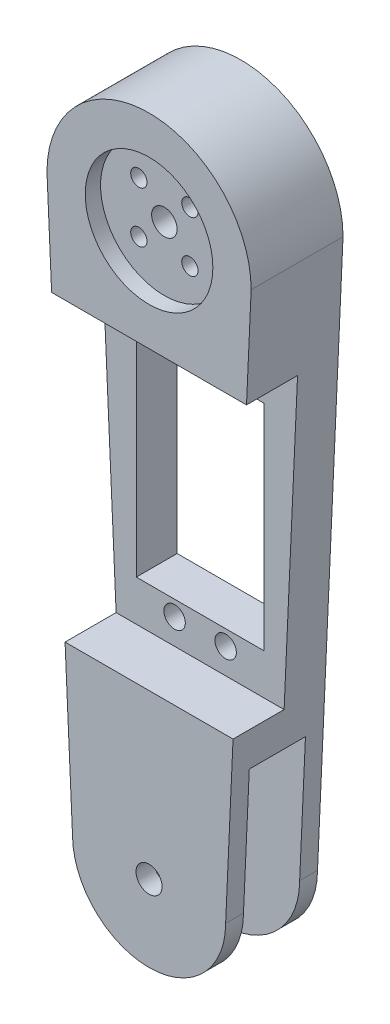
ISO-10303-21;
HEADER;
FILE_DESCRIPTION(('STEP AP214'),'2;1');
FILE_NAME('part.step','',(''),(''),'','','');
FILE_SCHEMA(('AUTOMOTIVE_DESIGN { 1 0 10303 214 1 1 1 1 }'));
ENDSEC;
DATA;
#1=APPLICATION_CONTEXT('core data for automotive mechanical design processes');
#2=APPLICATION_PROTOCOL_DEFINITION('international standard','automotive_design',2000,#1);
#3=PRODUCT_CONTEXT('',#1,'mechanical');
#4=PRODUCT('Part','Part','',(#3));
#5=PRODUCT_RELATED_PRODUCT_CATEGORY('part','',(#4));
#6=PRODUCT_DEFINITION_FORMATION('','',#4);
#7=PRODUCT_DEFINITION_CONTEXT('part definition',#1,'design');
#8=PRODUCT_DEFINITION('design','',#6,#7);
#9=PRODUCT_DEFINITION_SHAPE('','',#8);
#10=(LENGTH_UNIT() NAMED_UNIT(*) SI_UNIT(.MILLI.,.METRE.));
#11=(NAMED_UNIT(*) PLANE_ANGLE_UNIT() SI_UNIT($,.RADIAN.));
#12=(NAMED_UNIT(*) SI_UNIT($,.STERADIAN.) SOLID_ANGLE_UNIT());
#13=UNCERTAINTY_MEASURE_WITH_UNIT(LENGTH_MEASURE(1.E-05),#10,'distance_accuracy_value','');
#14=(GEOMETRIC_REPRESENTATION_CONTEXT(3) GLOBAL_UNCERTAINTY_ASSIGNED_CONTEXT((#13)) GLOBAL_UNIT_ASSIGNED_CONTEXT((#10,
#11,#12)) REPRESENTATION_CONTEXT('',''));
#15=CARTESIAN_POINT('',(0.,0.,0.));
#16=DIRECTION('',(0.,0.,1.));
#17=DIRECTION('',(1.,0.,0.));
#18=AXIS2_PLACEMENT_3D('',#15,#16,#17);
#19=CARTESIAN_POINT('',(0.,0.,18.));
#20=DIRECTION('',(0.,0.,1.));
#21=DIRECTION('',(1.,0.,0.));
#22=AXIS2_PLACEMENT_3D('',#19,#20,#21);
#23=PLANE('',#22);
#24=DIRECTION('',(-1.,0.,0.));
#25=VECTOR('',#24,1.);
#26=CARTESIAN_POINT('',(0.,90.,18.));
#27=LINE('',#26,#25);
#28=CARTESIAN_POINT('',(19.0909090909091,90.,18.));
#29=VERTEX_POINT('',#28);
#30=CARTESIAN_POINT('',(-19.0909090909091,90.,18.));
#31=VERTEX_POINT('',#30);
#32=EDGE_CURVE('E56',#29,#31,#27,.T.);
#33=ORIENTED_EDGE('',*,*,#32,.F.);
#34=DIRECTION('',(-0.0454076609186499,-0.9989685402103,0.));
#35=VECTOR('',#34,1.);
#36=CARTESIAN_POINT('',(14.9690721649485,-0.680412371134019,18.));
#37=LINE('',#36,#35);
#38=CARTESIAN_POINT('',(20.,110.,18.));
#39=VERTEX_POINT('',#38);
#40=EDGE_CURVE('E340',#39,#29,#37,.T.);
#41=ORIENTED_EDGE('',*,*,#40,.F.);
#42=CARTESIAN_POINT('',(0.,110.,18.));
#43=DIRECTION('',(0.,0.,1.));
#44=DIRECTION('',(1.,0.,0.));
#45=AXIS2_PLACEMENT_3D('',#42,#43,#44);
#46=CIRCLE('',#45,20.);
#47=CARTESIAN_POINT('',(-20.,110.,18.));
#48=VERTEX_POINT('',#47);
#49=EDGE_CURVE('E344',#39,#48,#46,.T.);
#50=ORIENTED_EDGE('',*,*,#49,.T.);
#51=DIRECTION('',(0.0454076609186501,-0.9989685402103,0.));
#52=VECTOR('',#51,1.);
#53=CARTESIAN_POINT('',(-14.9690721649485,-0.680412371134023,18.));
#54=LINE('',#53,#52);
#55=EDGE_CURVE('E348',#48,#31,#54,.T.);
#56=ORIENTED_EDGE('',*,*,#55,.T.);
#57=EDGE_LOOP('',(#33,#41,#50,#56));
#58=FACE_BOUND('',#57,.T.);
#59=CARTESIAN_POINT('',(0.,110.,18.));
#60=DIRECTION('',(0.,0.,1.));
#61=DIRECTION('',(1.,0.,0.));
#62=AXIS2_PLACEMENT_3D('',#59,#60,#61);
#63=CIRCLE('',#62,12.5);
#64=CARTESIAN_POINT('',(12.5,110.,18.));
#65=VERTEX_POINT('',#64);
#66=EDGE_CURVE('E316',#65,#65,#63,.T.);
#67=ORIENTED_EDGE('',*,*,#66,.F.);
#68=EDGE_LOOP('',(#67));
#69=FACE_BOUND('',#68,.T.);
#70=ADVANCED_FACE('F47',(#58,#69),#23,.T.);
#71=CARTESIAN_POINT('',(0.,0.,18.));
#72=DIRECTION('',(0.,0.,-1.));
#73=DIRECTION('',(-1.,0.,0.));
#74=AXIS2_PLACEMENT_3D('',#71,#72,#73);
#75=CYLINDRICAL_SURFACE('',#74,15.);
#76=CARTESIAN_POINT('',(0.,0.,3.5));
#77=DIRECTION('',(0.,0.,-1.));
#78=DIRECTION('',(-1.,0.,0.));
#79=AXIS2_PLACEMENT_3D('',#76,#77,#78);
#80=CIRCLE('',#79,15.);
#81=CARTESIAN_POINT('',(15.,0.,3.5));
#82=VERTEX_POINT('',#81);
#83=CARTESIAN_POINT('',(-15.,0.,3.5));
#84=VERTEX_POINT('',#83);
#85=EDGE_CURVE('E264',#82,#84,#80,.T.);
#86=ORIENTED_EDGE('',*,*,#85,.T.);
#87=DIRECTION('',(0.,0.,-1.));
#88=VECTOR('',#87,1.);
#89=CARTESIAN_POINT('',(-15.,0.,18.));
#90=LINE('',#89,#88);
#91=CARTESIAN_POINT('',(-15.,0.,0.));
#92=VERTEX_POINT('',#91);
#93=EDGE_CURVE('E352',#84,#92,#90,.T.);
#94=ORIENTED_EDGE('',*,*,#93,.T.);
#95=CARTESIAN_POINT('',(0.,0.,0.));
#96=DIRECTION('',(0.,0.,1.));
#97=DIRECTION('',(1.,0.,0.));
#98=AXIS2_PLACEMENT_3D('',#95,#96,#97);
#99=CIRCLE('',#98,15.);
#100=CARTESIAN_POINT('',(15.,0.,0.));
#101=VERTEX_POINT('',#100);
#102=EDGE_CURVE('E356',#92,#101,#99,.T.);
#103=ORIENTED_EDGE('',*,*,#102,.T.);
#104=DIRECTION('',(0.,0.,-1.));
#105=VECTOR('',#104,1.);
#106=CARTESIAN_POINT('',(15.,0.,18.));
#107=LINE('',#106,#105);
#108=EDGE_CURVE('E381',#82,#101,#107,.T.);
#109=ORIENTED_EDGE('',*,*,#108,.F.);
#110=EDGE_LOOP('',(#86,#94,#103,#109));
#111=FACE_BOUND('',#110,.T.);
#112=ADVANCED_FACE('F444',(#111),#75,.T.);
#113=CARTESIAN_POINT('',(0.,0.,18.));
#114=DIRECTION('',(0.,0.,-1.));
#115=DIRECTION('',(-1.,0.,0.));
#116=AXIS2_PLACEMENT_3D('',#113,#114,#115);
#117=CYLINDRICAL_SURFACE('',#116,2.55);
#118=CARTESIAN_POINT('',(0.,0.,14.5));
#119=DIRECTION('',(0.,0.,1.));
#120=DIRECTION('',(1.,0.,0.));
#121=AXIS2_PLACEMENT_3D('',#118,#119,#120);
#122=CIRCLE('',#121,2.55);
#123=CARTESIAN_POINT('',(2.55,0.,14.5));
#124=VERTEX_POINT('',#123);
#125=EDGE_CURVE('E287',#124,#124,#122,.T.);
#126=ORIENTED_EDGE('',*,*,#125,.F.);
#127=EDGE_LOOP('',(#126));
#128=FACE_BOUND('',#127,.T.);
#129=CARTESIAN_POINT('',(0.,0.,18.));
#130=DIRECTION('',(0.,0.,1.));
#131=DIRECTION('',(1.,0.,0.));
#132=AXIS2_PLACEMENT_3D('',#129,#130,#131);
#133=CIRCLE('',#132,2.55);
#134=CARTESIAN_POINT('',(2.55,0.,18.));
#135=VERTEX_POINT('',#134);
#136=EDGE_CURVE('E330',#135,#135,#133,.T.);
#137=ORIENTED_EDGE('',*,*,#136,.T.);
#138=EDGE_LOOP('',(#137));
#139=FACE_BOUND('',#138,.T.);
#140=ADVANCED_FACE('F500',(#128,#139),#117,.F.);
#141=CARTESIAN_POINT('',(0.,0.,14.5));
#142=DIRECTION('',(0.,0.,1.));
#143=DIRECTION('',(1.,0.,0.));
#144=AXIS2_PLACEMENT_3D('',#141,#142,#143);
#145=CIRCLE('',#144,15.);
#146=CARTESIAN_POINT('',(-15.,0.,14.5));
#147=VERTEX_POINT('',#146);
#148=CARTESIAN_POINT('',(15.,0.,14.5));
#149=VERTEX_POINT('',#148);
#150=EDGE_CURVE('E280',#147,#149,#145,.T.);
#151=ORIENTED_EDGE('',*,*,#150,.T.);
#152=CARTESIAN_POINT('',(15.,0.,18.));
#153=VERTEX_POINT('',#152);
#154=EDGE_CURVE('E382',#153,#149,#107,.T.);
#155=ORIENTED_EDGE('',*,*,#154,.F.);
#156=CARTESIAN_POINT('',(0.,0.,18.));
#157=DIRECTION('',(0.,0.,1.));
#158=DIRECTION('',(1.,0.,0.));
#159=AXIS2_PLACEMENT_3D('',#156,#157,#158);
#160=CIRCLE('',#159,15.);
#161=CARTESIAN_POINT('',(-15.,0.,18.));
#162=VERTEX_POINT('',#161);
#163=EDGE_CURVE('E334',#162,#153,#160,.T.);
#164=ORIENTED_EDGE('',*,*,#163,.F.);
#165=EDGE_CURVE('E370',#162,#147,#90,.T.);
#166=ORIENTED_EDGE('',*,*,#165,.T.);
#167=EDGE_LOOP('',(#151,#155,#164,#166));
#168=FACE_BOUND('',#167,.T.);
#169=ADVANCED_FACE('F463',(#168),#75,.T.);
#170=CARTESIAN_POINT('',(14.9690721649485,-0.680412371134019,18.));
#171=DIRECTION('',(0.9989685402103,-0.0454076609186499,0.));
#172=DIRECTION('',(0.0454076609186499,0.9989685402103,0.));
#173=AXIS2_PLACEMENT_3D('',#170,#171,#172);
#174=PLANE('',#173);
#175=DIRECTION('',(0.,0.,1.));
#176=VECTOR('',#175,1.);
#177=CARTESIAN_POINT('',(19.0909090909091,90.,18.));
#178=LINE('',#177,#176);
#179=CARTESIAN_POINT('',(19.0909090909091,90.,8.));
#180=VERTEX_POINT('',#179);
#181=EDGE_CURVE('E252',#180,#29,#178,.T.);
#182=ORIENTED_EDGE('',*,*,#181,.F.);
#183=DIRECTION('',(-0.0454076609186499,-0.9989685402103,0.));
#184=VECTOR('',#183,1.);
#185=CARTESIAN_POINT('',(14.9690721649485,-0.680412371134019,8.));
#186=LINE('',#185,#184);
#187=CARTESIAN_POINT('',(16.4545454545455,32.,8.));
#188=VERTEX_POINT('',#187);
#189=EDGE_CURVE('E255',#180,#188,#186,.T.);
#190=ORIENTED_EDGE('',*,*,#189,.T.);
#191=DIRECTION('',(0.,0.,-1.));
#192=VECTOR('',#191,1.);
#193=CARTESIAN_POINT('',(16.4545454545454,32.,18.));
#194=LINE('',#193,#192);
#195=CARTESIAN_POINT('',(16.4545454545454,32.,18.));
#196=VERTEX_POINT('',#195);
#197=EDGE_CURVE('E245',#196,#188,#194,.T.);
#198=ORIENTED_EDGE('',*,*,#197,.F.);
#199=EDGE_CURVE('E339',#196,#153,#37,.T.);
#200=ORIENTED_EDGE('',*,*,#199,.T.);
#201=ORIENTED_EDGE('',*,*,#154,.T.);
#202=DIRECTION('',(-0.0454076609186499,-0.9989685402103,0.));
#203=VECTOR('',#202,1.);
#204=CARTESIAN_POINT('',(14.9690721649485,-0.680412371134019,14.5));
#205=LINE('',#204,#203);
#206=CARTESIAN_POINT('',(16.1363636363636,25.,14.5));
#207=VERTEX_POINT('',#206);
#208=EDGE_CURVE('E283',#207,#149,#205,.T.);
#209=ORIENTED_EDGE('',*,*,#208,.F.);
#210=DIRECTION('',(0.,0.,1.));
#211=VECTOR('',#210,1.);
#212=CARTESIAN_POINT('',(16.1363636363636,25.,18.));
#213=LINE('',#212,#211);
#214=CARTESIAN_POINT('',(16.1363636363636,25.,3.5));
#215=VERTEX_POINT('',#214);
#216=EDGE_CURVE('E277',#215,#207,#213,.T.);
#217=ORIENTED_EDGE('',*,*,#216,.F.);
#218=DIRECTION('',(0.0454076609186499,0.9989685402103,0.));
#219=VECTOR('',#218,1.);
#220=CARTESIAN_POINT('',(14.9690721649485,-0.680412371134019,3.5));
#221=LINE('',#220,#219);
#222=EDGE_CURVE('E270',#82,#215,#221,.T.);
#223=ORIENTED_EDGE('',*,*,#222,.F.);
#224=ORIENTED_EDGE('',*,*,#108,.T.);
#225=DIRECTION('',(-0.0454076609186499,-0.9989685402103,0.));
#226=VECTOR('',#225,1.);
#227=CARTESIAN_POINT('',(14.9690721649485,-0.680412371134019,0.));
#228=LINE('',#227,#226);
#229=CARTESIAN_POINT('',(20.,110.,0.));
#230=VERTEX_POINT('',#229);
#231=EDGE_CURVE('E360',#230,#101,#228,.T.);
#232=ORIENTED_EDGE('',*,*,#231,.F.);
#233=DIRECTION('',(0.,0.,-1.));
#234=VECTOR('',#233,1.);
#235=CARTESIAN_POINT('',(20.,110.,18.));
#236=LINE('',#235,#234);
#237=EDGE_CURVE('E378',#39,#230,#236,.T.);
#238=ORIENTED_EDGE('',*,*,#237,.F.);
#239=ORIENTED_EDGE('',*,*,#40,.T.);
#240=EDGE_LOOP('',(#182,#190,#198,#200,#201,#209,#217,#223,#224,#232,#238,#239));
#241=FACE_BOUND('',#240,.T.);
#242=ADVANCED_FACE('F452',(#241),#174,.T.);
#243=CARTESIAN_POINT('',(0.,110.,18.));
#244=DIRECTION('',(0.,0.,-1.));
#245=DIRECTION('',(-1.,0.,0.));
#246=AXIS2_PLACEMENT_3D('',#243,#244,#245);
#247=CYLINDRICAL_SURFACE('',#246,20.);
#248=CARTESIAN_POINT('',(0.,110.,0.));
#249=DIRECTION('',(0.,0.,1.));
#250=DIRECTION('',(1.,0.,0.));
#251=AXIS2_PLACEMENT_3D('',#248,#249,#250);
#252=CIRCLE('',#251,20.);
#253=CARTESIAN_POINT('',(-20.,110.,0.));
#254=VERTEX_POINT('',#253);
#255=EDGE_CURVE('E364',#230,#254,#252,.T.);
#256=ORIENTED_EDGE('',*,*,#255,.T.);
#257=DIRECTION('',(0.,0.,-1.));
#258=VECTOR('',#257,1.);
#259=CARTESIAN_POINT('',(-20.,110.,18.));
#260=LINE('',#259,#258);
#261=EDGE_CURVE('E374',#48,#254,#260,.T.);
#262=ORIENTED_EDGE('',*,*,#261,.F.);
#263=ORIENTED_EDGE('',*,*,#49,.F.);
#264=ORIENTED_EDGE('',*,*,#237,.T.);
#265=EDGE_LOOP('',(#256,#262,#263,#264));
#266=FACE_BOUND('',#265,.T.);
#267=ADVANCED_FACE('F434',(#266),#247,.T.);
#268=CARTESIAN_POINT('',(0.,0.,3.5));
#269=DIRECTION('',(0.,0.,-1.));
#270=DIRECTION('',(-1.,0.,0.));
#271=AXIS2_PLACEMENT_3D('',#268,#269,#270);
#272=CIRCLE('',#271,2.55);
#273=CARTESIAN_POINT('',(-2.55,0.,3.5));
#274=VERTEX_POINT('',#273);
#275=EDGE_CURVE('E273',#274,#274,#272,.T.);
#276=ORIENTED_EDGE('',*,*,#275,.F.);
#277=EDGE_LOOP('',(#276));
#278=FACE_BOUND('',#277,.T.);
#279=CARTESIAN_POINT('',(0.,0.,0.));
#280=DIRECTION('',(0.,0.,1.));
#281=DIRECTION('',(1.,0.,0.));
#282=AXIS2_PLACEMENT_3D('',#279,#280,#281);
#283=CIRCLE('',#282,2.55);
#284=CARTESIAN_POINT('',(2.55,0.,0.));
#285=VERTEX_POINT('',#284);
#286=EDGE_CURVE('E326',#285,#285,#283,.T.);
#287=ORIENTED_EDGE('',*,*,#286,.F.);
#288=EDGE_LOOP('',(#287));
#289=FACE_BOUND('',#288,.T.);
#290=ADVANCED_FACE('F49',(#278,#289),#117,.F.);
#291=CARTESIAN_POINT('',(-14.9690721649485,-0.680412371134023,18.));
#292=DIRECTION('',(0.9989685402103,0.0454076609186501,0.));
#293=DIRECTION('',(-0.0454076609186501,0.9989685402103,0.));
#294=AXIS2_PLACEMENT_3D('',#291,#292,#293);
#295=PLANE('',#294);
#296=DIRECTION('',(0.0454076609186501,-0.9989685402103,0.));
#297=VECTOR('',#296,1.);
#298=CARTESIAN_POINT('',(-14.9690721649485,-0.680412371134023,8.));
#299=LINE('',#298,#297);
#300=CARTESIAN_POINT('',(-19.0909090909091,90.,8.));
#301=VERTEX_POINT('',#300);
#302=CARTESIAN_POINT('',(-16.4545454545455,32.,8.));
#303=VERTEX_POINT('',#302);
#304=EDGE_CURVE('E11',#301,#303,#299,.T.);
#305=ORIENTED_EDGE('',*,*,#304,.F.);
#306=DIRECTION('',(0.,0.,1.));
#307=VECTOR('',#306,1.);
#308=CARTESIAN_POINT('',(-19.0909090909091,90.,18.));
#309=LINE('',#308,#307);
#310=EDGE_CURVE('E248',#301,#31,#309,.T.);
#311=ORIENTED_EDGE('',*,*,#310,.T.);
#312=ORIENTED_EDGE('',*,*,#55,.F.);
#313=ORIENTED_EDGE('',*,*,#261,.T.);
#314=DIRECTION('',(0.0454076609186501,-0.9989685402103,0.));
#315=VECTOR('',#314,1.);
#316=CARTESIAN_POINT('',(-14.9690721649485,-0.680412371134023,0.));
#317=LINE('',#316,#315);
#318=EDGE_CURVE('E335',#254,#92,#317,.T.);
#319=ORIENTED_EDGE('',*,*,#318,.T.);
#320=ORIENTED_EDGE('',*,*,#93,.F.);
#321=DIRECTION('',(-0.0454076609186501,0.9989685402103,0.));
#322=VECTOR('',#321,1.);
#323=CARTESIAN_POINT('',(-14.9690721649485,-0.680412371134023,3.5));
#324=LINE('',#323,#322);
#325=CARTESIAN_POINT('',(-16.1363636363636,25.,3.5));
#326=VERTEX_POINT('',#325);
#327=EDGE_CURVE('E386',#84,#326,#324,.T.);
#328=ORIENTED_EDGE('',*,*,#327,.T.);
#329=DIRECTION('',(0.,0.,1.));
#330=VECTOR('',#329,1.);
#331=CARTESIAN_POINT('',(-16.1363636363636,25.,18.));
#332=LINE('',#331,#330);
#333=CARTESIAN_POINT('',(-16.1363636363636,25.,14.5));
#334=VERTEX_POINT('',#333);
#335=EDGE_CURVE('E408',#326,#334,#332,.T.);
#336=ORIENTED_EDGE('',*,*,#335,.T.);
#337=DIRECTION('',(0.0454076609186501,-0.9989685402103,0.));
#338=VECTOR('',#337,1.);
#339=CARTESIAN_POINT('',(-14.9690721649485,-0.680412371134023,14.5));
#340=LINE('',#339,#338);
#341=EDGE_CURVE('E412',#334,#147,#340,.T.);
#342=ORIENTED_EDGE('',*,*,#341,.T.);
#343=ORIENTED_EDGE('',*,*,#165,.F.);
#344=CARTESIAN_POINT('',(-16.4545454545455,32.,18.));
#345=VERTEX_POINT('',#344);
#346=EDGE_CURVE('E347',#345,#162,#54,.T.);
#347=ORIENTED_EDGE('',*,*,#346,.F.);
#348=DIRECTION('',(0.,0.,-1.));
#349=VECTOR('',#348,1.);
#350=CARTESIAN_POINT('',(-16.4545454545455,32.,18.));
#351=LINE('',#350,#349);
#352=EDGE_CURVE('E241',#345,#303,#351,.T.);
#353=ORIENTED_EDGE('',*,*,#352,.T.);
#354=EDGE_LOOP('',(#305,#311,#312,#313,#319,#320,#328,#336,#342,#343,#347,#353));
#355=FACE_BOUND('',#354,.T.);
#356=ADVANCED_FACE('F429',(#355),#295,.F.);
#357=DIRECTION('',(1.,0.,0.));
#358=VECTOR('',#357,1.);
#359=CARTESIAN_POINT('',(0.,32.,18.));
#360=LINE('',#359,#358);
#361=EDGE_CURVE('E416',#345,#196,#360,.T.);
#362=ORIENTED_EDGE('',*,*,#361,.F.);
#363=ORIENTED_EDGE('',*,*,#346,.T.);
#364=ORIENTED_EDGE('',*,*,#163,.T.);
#365=ORIENTED_EDGE('',*,*,#199,.F.);
#366=EDGE_LOOP('',(#362,#363,#364,#365));
#367=FACE_BOUND('',#366,.T.);
#368=ORIENTED_EDGE('',*,*,#136,.F.);
#369=EDGE_LOOP('',(#368));
#370=FACE_BOUND('',#369,.T.);
#371=ADVANCED_FACE('F458',(#367,#370),#23,.T.);
#372=CARTESIAN_POINT('',(0.,0.,0.));
#373=DIRECTION('',(0.,0.,1.));
#374=DIRECTION('',(1.,0.,0.));
#375=AXIS2_PLACEMENT_3D('',#372,#373,#374);
#376=PLANE('',#375);
#377=CARTESIAN_POINT('',(-5.00000000000001,37.,0.));
#378=DIRECTION('',(0.,0.,1.));
#379=DIRECTION('',(-1.,0.,0.));
#380=AXIS2_PLACEMENT_3D('',#377,#378,#379);
#381=CIRCLE('',#380,2.1);
#382=CARTESIAN_POINT('',(-7.10000000000001,37.,0.));
#383=VERTEX_POINT('',#382);
#384=EDGE_CURVE('E226',#383,#383,#381,.T.);
#385=ORIENTED_EDGE('',*,*,#384,.T.);
#386=EDGE_LOOP('',(#385));
#387=FACE_BOUND('',#386,.T.);
#388=CARTESIAN_POINT('',(5.00000000000017,37.0000000000002,0.));
#389=DIRECTION('',(0.,0.,1.));
#390=DIRECTION('',(1.,0.,0.));
#391=AXIS2_PLACEMENT_3D('',#388,#389,#390);
#392=CIRCLE('',#391,2.10000000000001);
#393=CARTESIAN_POINT('',(7.10000000000018,37.0000000000002,0.));
#394=VERTEX_POINT('',#393);
#395=EDGE_CURVE('E218',#394,#394,#392,.T.);
#396=ORIENTED_EDGE('',*,*,#395,.T.);
#397=EDGE_LOOP('',(#396));
#398=FACE_BOUND('',#397,.T.);
#399=CARTESIAN_POINT('',(5.00000000000017,84.9999999999998,0.));
#400=DIRECTION('',(0.,0.,1.));
#401=DIRECTION('',(-1.,0.,0.));
#402=AXIS2_PLACEMENT_3D('',#399,#400,#401);
#403=CIRCLE('',#402,2.10000000000001);
#404=CARTESIAN_POINT('',(2.90000000000016,84.9999999999998,0.));
#405=VERTEX_POINT('',#404);
#406=EDGE_CURVE('E210',#405,#405,#403,.T.);
#407=ORIENTED_EDGE('',*,*,#406,.T.);
#408=EDGE_LOOP('',(#407));
#409=FACE_BOUND('',#408,.T.);
#410=DIRECTION('',(-1.,0.,0.));
#411=VECTOR('',#410,1.);
#412=CARTESIAN_POINT('',(-12.5,82.,0.));
#413=LINE('',#412,#411);
#414=CARTESIAN_POINT('',(12.5,82.,0.));
#415=VERTEX_POINT('',#414);
#416=CARTESIAN_POINT('',(-12.5,82.,0.));
#417=VERTEX_POINT('',#416);
#418=EDGE_CURVE('E195',#415,#417,#413,.T.);
#419=ORIENTED_EDGE('',*,*,#418,.T.);
#420=DIRECTION('',(0.,-1.,0.));
#421=VECTOR('',#420,1.);
#422=CARTESIAN_POINT('',(-12.5,82.,0.));
#423=LINE('',#422,#421);
#424=CARTESIAN_POINT('',(-12.5,40.,0.));
#425=VERTEX_POINT('',#424);
#426=EDGE_CURVE('E162',#417,#425,#423,.T.);
#427=ORIENTED_EDGE('',*,*,#426,.T.);
#428=DIRECTION('',(1.,0.,0.));
#429=VECTOR('',#428,1.);
#430=CARTESIAN_POINT('',(-12.5,40.,0.));
#431=LINE('',#430,#429);
#432=CARTESIAN_POINT('',(12.5,40.,0.));
#433=VERTEX_POINT('',#432);
#434=EDGE_CURVE('E201',#425,#433,#431,.T.);
#435=ORIENTED_EDGE('',*,*,#434,.T.);
#436=DIRECTION('',(0.,1.,0.));
#437=VECTOR('',#436,1.);
#438=CARTESIAN_POINT('',(12.5,82.,0.));
#439=LINE('',#438,#437);
#440=EDGE_CURVE('E63',#433,#415,#439,.T.);
#441=ORIENTED_EDGE('',*,*,#440,.T.);
#442=EDGE_LOOP('',(#419,#427,#435,#441));
#443=FACE_BOUND('',#442,.T.);
#444=CARTESIAN_POINT('',(-5.00000000000001,85.,0.));
#445=DIRECTION('',(0.,0.,1.));
#446=DIRECTION('',(1.,0.,0.));
#447=AXIS2_PLACEMENT_3D('',#444,#445,#446);
#448=CIRCLE('',#447,2.10000000000001);
#449=CARTESIAN_POINT('',(-2.9,85.,0.));
#450=VERTEX_POINT('',#449);
#451=EDGE_CURVE('E190',#450,#450,#448,.T.);
#452=ORIENTED_EDGE('',*,*,#451,.T.);
#453=EDGE_LOOP('',(#452));
#454=FACE_BOUND('',#453,.T.);
#455=CARTESIAN_POINT('',(0.,110.,0.));
#456=DIRECTION('',(0.,0.,-1.));
#457=DIRECTION('',(-1.,0.,0.));
#458=AXIS2_PLACEMENT_3D('',#455,#456,#457);
#459=CIRCLE('',#458,12.5);
#460=CARTESIAN_POINT('',(-12.5,110.,0.));
#461=VERTEX_POINT('',#460);
#462=EDGE_CURVE('E317',#461,#461,#459,.T.);
#463=ORIENTED_EDGE('',*,*,#462,.F.);
#464=EDGE_LOOP('',(#463));
#465=FACE_BOUND('',#464,.T.);
#466=ORIENTED_EDGE('',*,*,#286,.T.);
#467=EDGE_LOOP('',(#466));
#468=FACE_BOUND('',#467,.T.);
#469=ORIENTED_EDGE('',*,*,#102,.F.);
#470=ORIENTED_EDGE('',*,*,#318,.F.);
#471=ORIENTED_EDGE('',*,*,#255,.F.);
#472=ORIENTED_EDGE('',*,*,#231,.T.);
#473=EDGE_LOOP('',(#469,#470,#471,#472));
#474=FACE_BOUND('',#473,.T.);
#475=ADVANCED_FACE('F440',(#387,#398,#409,#443,#454,#465,#468,#474),#376,.F.);
#476=CARTESIAN_POINT('',(0.,110.,15.));
#477=DIRECTION('',(0.,0.,1.));
#478=DIRECTION('',(1.,0.,0.));
#479=AXIS2_PLACEMENT_3D('',#476,#477,#478);
#480=CYLINDRICAL_SURFACE('',#479,12.5);
#481=CARTESIAN_POINT('',(0.,110.,15.));
#482=DIRECTION('',(0.,0.,1.));
#483=DIRECTION('',(1.,0.,0.));
#484=AXIS2_PLACEMENT_3D('',#481,#482,#483);
#485=CIRCLE('',#484,12.5);
#486=CARTESIAN_POINT('',(12.5,110.,15.));
#487=VERTEX_POINT('',#486);
#488=EDGE_CURVE('E322',#487,#487,#485,.T.);
#489=ORIENTED_EDGE('',*,*,#488,.F.);
#490=EDGE_LOOP('',(#489));
#491=FACE_BOUND('',#490,.T.);
#492=ORIENTED_EDGE('',*,*,#66,.T.);
#493=EDGE_LOOP('',(#492));
#494=FACE_BOUND('',#493,.T.);
#495=ADVANCED_FACE('F507',(#491,#494),#480,.F.);
#496=CARTESIAN_POINT('',(0.,110.,15.));
#497=DIRECTION('',(0.,0.,1.));
#498=DIRECTION('',(1.,0.,0.));
#499=AXIS2_PLACEMENT_3D('',#496,#497,#498);
#500=PLANE('',#499);
#501=CARTESIAN_POINT('',(0.,110.,15.));
#502=DIRECTION('',(0.,0.,1.));
#503=DIRECTION('',(1.,0.,0.));
#504=AXIS2_PLACEMENT_3D('',#501,#502,#503);
#505=CIRCLE('',#504,2.5);
#506=CARTESIAN_POINT('',(2.49999999999999,110.,15.));
#507=VERTEX_POINT('',#506);
#508=EDGE_CURVE('E296',#507,#507,#505,.T.);
#509=ORIENTED_EDGE('',*,*,#508,.F.);
#510=EDGE_LOOP('',(#509));
#511=FACE_BOUND('',#510,.T.);
#512=CARTESIAN_POINT('',(5.,115.,15.));
#513=DIRECTION('',(0.,0.,1.));
#514=DIRECTION('',(-1.,0.,0.));
#515=AXIS2_PLACEMENT_3D('',#512,#513,#514);
#516=CIRCLE('',#515,1.6);
#517=CARTESIAN_POINT('',(3.4,115.,15.));
#518=VERTEX_POINT('',#517);
#519=EDGE_CURVE('E291',#518,#518,#516,.T.);
#520=ORIENTED_EDGE('',*,*,#519,.F.);
#521=EDGE_LOOP('',(#520));
#522=FACE_BOUND('',#521,.T.);
#523=CARTESIAN_POINT('',(5.,105.,15.));
#524=DIRECTION('',(0.,0.,1.));
#525=DIRECTION('',(1.,0.,0.));
#526=AXIS2_PLACEMENT_3D('',#523,#524,#525);
#527=CIRCLE('',#526,1.6);
#528=CARTESIAN_POINT('',(6.6,105.,15.));
#529=VERTEX_POINT('',#528);
#530=EDGE_CURVE('E301',#529,#529,#527,.T.);
#531=ORIENTED_EDGE('',*,*,#530,.F.);
#532=EDGE_LOOP('',(#531));
#533=FACE_BOUND('',#532,.T.);
#534=CARTESIAN_POINT('',(-5.,105.,15.));
#535=DIRECTION('',(0.,0.,1.));
#536=DIRECTION('',(-1.,0.,0.));
#537=AXIS2_PLACEMENT_3D('',#534,#535,#536);
#538=CIRCLE('',#537,1.6);
#539=CARTESIAN_POINT('',(-6.6,105.,15.));
#540=VERTEX_POINT('',#539);
#541=EDGE_CURVE('E297',#540,#540,#538,.T.);
#542=ORIENTED_EDGE('',*,*,#541,.F.);
#543=EDGE_LOOP('',(#542));
#544=FACE_BOUND('',#543,.T.);
#545=CARTESIAN_POINT('',(-5.,115.,15.));
#546=DIRECTION('',(0.,0.,1.));
#547=DIRECTION('',(1.,0.,0.));
#548=AXIS2_PLACEMENT_3D('',#545,#546,#547);
#549=CIRCLE('',#548,1.6);
#550=CARTESIAN_POINT('',(-3.4,115.,15.));
#551=VERTEX_POINT('',#550);
#552=EDGE_CURVE('E292',#551,#551,#549,.T.);
#553=ORIENTED_EDGE('',*,*,#552,.F.);
#554=EDGE_LOOP('',(#553));
#555=FACE_BOUND('',#554,.T.);
#556=ORIENTED_EDGE('',*,*,#488,.T.);
#557=EDGE_LOOP('',(#556));
#558=FACE_BOUND('',#557,.T.);
#559=ADVANCED_FACE('F562',(#511,#522,#533,#544,#555,#558),#500,.T.);
#560=CARTESIAN_POINT('',(0.,110.,3.));
#561=DIRECTION('',(0.,0.,-1.));
#562=DIRECTION('',(-1.,0.,0.));
#563=AXIS2_PLACEMENT_3D('',#560,#561,#562);
#564=CYLINDRICAL_SURFACE('',#563,12.5);
#565=CARTESIAN_POINT('',(0.,110.,3.));
#566=DIRECTION('',(0.,0.,-1.));
#567=DIRECTION('',(-1.,0.,0.));
#568=AXIS2_PLACEMENT_3D('',#565,#566,#567);
#569=CIRCLE('',#568,12.5);
#570=CARTESIAN_POINT('',(-12.5,110.,3.));
#571=VERTEX_POINT('',#570);
#572=EDGE_CURVE('E312',#571,#571,#569,.T.);
#573=ORIENTED_EDGE('',*,*,#572,.F.);
#574=EDGE_LOOP('',(#573));
#575=FACE_BOUND('',#574,.T.);
#576=ORIENTED_EDGE('',*,*,#462,.T.);
#577=EDGE_LOOP('',(#576));
#578=FACE_BOUND('',#577,.T.);
#579=ADVANCED_FACE('F558',(#575,#578),#564,.F.);
#580=CARTESIAN_POINT('',(0.,110.,3.));
#581=DIRECTION('',(0.,0.,-1.));
#582=DIRECTION('',(-1.,0.,0.));
#583=AXIS2_PLACEMENT_3D('',#580,#581,#582);
#584=PLANE('',#583);
#585=CARTESIAN_POINT('',(5.,115.,3.));
#586=DIRECTION('',(0.,0.,-1.));
#587=DIRECTION('',(-1.,0.,0.));
#588=AXIS2_PLACEMENT_3D('',#585,#586,#587);
#589=CIRCLE('',#588,1.6);
#590=CARTESIAN_POINT('',(3.4,115.,3.));
#591=VERTEX_POINT('',#590);
#592=EDGE_CURVE('E321',#591,#591,#589,.T.);
#593=ORIENTED_EDGE('',*,*,#592,.F.);
#594=EDGE_LOOP('',(#593));
#595=FACE_BOUND('',#594,.T.);
#596=CARTESIAN_POINT('',(5.,105.,3.));
#597=DIRECTION('',(0.,0.,-1.));
#598=DIRECTION('',(-1.,0.,0.));
#599=AXIS2_PLACEMENT_3D('',#596,#597,#598);
#600=CIRCLE('',#599,1.6);
#601=CARTESIAN_POINT('',(3.4,105.,3.));
#602=VERTEX_POINT('',#601);
#603=EDGE_CURVE('E398',#602,#602,#600,.T.);
#604=ORIENTED_EDGE('',*,*,#603,.F.);
#605=EDGE_LOOP('',(#604));
#606=FACE_BOUND('',#605,.T.);
#607=CARTESIAN_POINT('',(-5.,105.,3.));
#608=DIRECTION('',(0.,0.,-1.));
#609=DIRECTION('',(-1.,0.,0.));
#610=AXIS2_PLACEMENT_3D('',#607,#608,#609);
#611=CIRCLE('',#610,1.6);
#612=CARTESIAN_POINT('',(-6.6,105.,3.));
#613=VERTEX_POINT('',#612);
#614=EDGE_CURVE('E394',#613,#613,#611,.T.);
#615=ORIENTED_EDGE('',*,*,#614,.F.);
#616=EDGE_LOOP('',(#615));
#617=FACE_BOUND('',#616,.T.);
#618=CARTESIAN_POINT('',(-5.,115.,3.));
#619=DIRECTION('',(0.,0.,-1.));
#620=DIRECTION('',(-1.,0.,0.));
#621=AXIS2_PLACEMENT_3D('',#618,#619,#620);
#622=CIRCLE('',#621,1.6);
#623=CARTESIAN_POINT('',(-6.6,115.,3.));
#624=VERTEX_POINT('',#623);
#625=EDGE_CURVE('E390',#624,#624,#622,.T.);
#626=ORIENTED_EDGE('',*,*,#625,.F.);
#627=EDGE_LOOP('',(#626));
#628=FACE_BOUND('',#627,.T.);
#629=CARTESIAN_POINT('',(0.,110.,3.));
#630=DIRECTION('',(0.,0.,-1.));
#631=DIRECTION('',(-1.,0.,0.));
#632=AXIS2_PLACEMENT_3D('',#629,#630,#631);
#633=CIRCLE('',#632,2.5);
#634=CARTESIAN_POINT('',(-2.50000000000002,110.,3.));
#635=VERTEX_POINT('',#634);
#636=EDGE_CURVE('E311',#635,#635,#633,.T.);
#637=ORIENTED_EDGE('',*,*,#636,.F.);
#638=EDGE_LOOP('',(#637));
#639=FACE_BOUND('',#638,.T.);
#640=ORIENTED_EDGE('',*,*,#572,.T.);
#641=EDGE_LOOP('',(#640));
#642=FACE_BOUND('',#641,.T.);
#643=ADVANCED_FACE('F554',(#595,#606,#617,#628,#639,#642),#584,.T.);
#644=CARTESIAN_POINT('',(0.,110.,0.));
#645=DIRECTION('',(0.,0.,1.));
#646=DIRECTION('',(1.,0.,0.));
#647=AXIS2_PLACEMENT_3D('',#644,#645,#646);
#648=CYLINDRICAL_SURFACE('',#647,2.5);
#649=ORIENTED_EDGE('',*,*,#636,.T.);
#650=EDGE_LOOP('',(#649));
#651=FACE_BOUND('',#650,.T.);
#652=ORIENTED_EDGE('',*,*,#508,.T.);
#653=EDGE_LOOP('',(#652));
#654=FACE_BOUND('',#653,.T.);
#655=ADVANCED_FACE('F544',(#651,#654),#648,.F.);
#656=CARTESIAN_POINT('',(-5.,115.,0.));
#657=DIRECTION('',(0.,0.,1.));
#658=DIRECTION('',(1.,0.,0.));
#659=AXIS2_PLACEMENT_3D('',#656,#657,#658);
#660=CYLINDRICAL_SURFACE('',#659,1.6);
#661=ORIENTED_EDGE('',*,*,#625,.T.);
#662=EDGE_LOOP('',(#661));
#663=FACE_BOUND('',#662,.T.);
#664=ORIENTED_EDGE('',*,*,#552,.T.);
#665=EDGE_LOOP('',(#664));
#666=FACE_BOUND('',#665,.T.);
#667=ADVANCED_FACE('F540',(#663,#666),#660,.F.);
#668=CARTESIAN_POINT('',(-5.,105.,0.));
#669=DIRECTION('',(0.,0.,1.));
#670=DIRECTION('',(1.,0.,0.));
#671=AXIS2_PLACEMENT_3D('',#668,#669,#670);
#672=CYLINDRICAL_SURFACE('',#671,1.6);
#673=ORIENTED_EDGE('',*,*,#614,.T.);
#674=EDGE_LOOP('',(#673));
#675=FACE_BOUND('',#674,.T.);
#676=ORIENTED_EDGE('',*,*,#541,.T.);
#677=EDGE_LOOP('',(#676));
#678=FACE_BOUND('',#677,.T.);
#679=ADVANCED_FACE('F543',(#675,#678),#672,.F.);
#680=CARTESIAN_POINT('',(5.,105.,0.));
#681=DIRECTION('',(0.,0.,1.));
#682=DIRECTION('',(1.,0.,0.));
#683=AXIS2_PLACEMENT_3D('',#680,#681,#682);
#684=CYLINDRICAL_SURFACE('',#683,1.6);
#685=ORIENTED_EDGE('',*,*,#603,.T.);
#686=EDGE_LOOP('',(#685));
#687=FACE_BOUND('',#686,.T.);
#688=ORIENTED_EDGE('',*,*,#530,.T.);
#689=EDGE_LOOP('',(#688));
#690=FACE_BOUND('',#689,.T.);
#691=ADVANCED_FACE('F536',(#687,#690),#684,.F.);
#692=CARTESIAN_POINT('',(5.,115.,0.));
#693=DIRECTION('',(0.,0.,1.));
#694=DIRECTION('',(1.,0.,0.));
#695=AXIS2_PLACEMENT_3D('',#692,#693,#694);
#696=CYLINDRICAL_SURFACE('',#695,1.6);
#697=ORIENTED_EDGE('',*,*,#592,.T.);
#698=EDGE_LOOP('',(#697));
#699=FACE_BOUND('',#698,.T.);
#700=ORIENTED_EDGE('',*,*,#519,.T.);
#701=EDGE_LOOP('',(#700));
#702=FACE_BOUND('',#701,.T.);
#703=ADVANCED_FACE('F529',(#699,#702),#696,.F.);
#704=CARTESIAN_POINT('',(-20.,-15.,14.5));
#705=DIRECTION('',(0.,0.,1.));
#706=DIRECTION('',(1.,0.,0.));
#707=AXIS2_PLACEMENT_3D('',#704,#705,#706);
#708=PLANE('',#707);
#709=ORIENTED_EDGE('',*,*,#125,.T.);
#710=EDGE_LOOP('',(#709));
#711=FACE_BOUND('',#710,.T.);
#712=ORIENTED_EDGE('',*,*,#208,.T.);
#713=ORIENTED_EDGE('',*,*,#150,.F.);
#714=ORIENTED_EDGE('',*,*,#341,.F.);
#715=DIRECTION('',(1.,0.,0.));
#716=VECTOR('',#715,1.);
#717=CARTESIAN_POINT('',(-20.,25.,14.5));
#718=LINE('',#717,#716);
#719=EDGE_CURVE('E260',#334,#207,#718,.T.);
#720=ORIENTED_EDGE('',*,*,#719,.T.);
#721=EDGE_LOOP('',(#712,#713,#714,#720));
#722=FACE_BOUND('',#721,.T.);
#723=ADVANCED_FACE('F465',(#711,#722),#708,.F.);
#724=CARTESIAN_POINT('',(-20.,25.,14.5));
#725=DIRECTION('',(0.,1.,0.));
#726=DIRECTION('',(0.,0.,1.));
#727=AXIS2_PLACEMENT_3D('',#724,#725,#726);
#728=PLANE('',#727);
#729=ORIENTED_EDGE('',*,*,#216,.T.);
#730=ORIENTED_EDGE('',*,*,#719,.F.);
#731=ORIENTED_EDGE('',*,*,#335,.F.);
#732=DIRECTION('',(1.,0.,0.));
#733=VECTOR('',#732,1.);
#734=CARTESIAN_POINT('',(-20.,25.,3.5));
#735=LINE('',#734,#733);
#736=EDGE_CURVE('E259',#326,#215,#735,.T.);
#737=ORIENTED_EDGE('',*,*,#736,.T.);
#738=EDGE_LOOP('',(#729,#730,#731,#737));
#739=FACE_BOUND('',#738,.T.);
#740=ADVANCED_FACE('F470',(#739),#728,.F.);
#741=CARTESIAN_POINT('',(-20.,-15.,3.5));
#742=DIRECTION('',(0.,0.,-1.));
#743=DIRECTION('',(-1.,0.,0.));
#744=AXIS2_PLACEMENT_3D('',#741,#742,#743);
#745=PLANE('',#744);
#746=ORIENTED_EDGE('',*,*,#275,.T.);
#747=EDGE_LOOP('',(#746));
#748=FACE_BOUND('',#747,.T.);
#749=ORIENTED_EDGE('',*,*,#222,.T.);
#750=ORIENTED_EDGE('',*,*,#736,.F.);
#751=ORIENTED_EDGE('',*,*,#327,.F.);
#752=ORIENTED_EDGE('',*,*,#85,.F.);
#753=EDGE_LOOP('',(#749,#750,#751,#752));
#754=FACE_BOUND('',#753,.T.);
#755=ADVANCED_FACE('F473',(#748,#754),#745,.F.);
#756=CARTESIAN_POINT('',(0.,0.,8.));
#757=DIRECTION('',(0.,0.,1.));
#758=DIRECTION('',(1.,0.,0.));
#759=AXIS2_PLACEMENT_3D('',#756,#757,#758);
#760=PLANE('',#759);
#761=CARTESIAN_POINT('',(-5.00000000000001,37.,8.));
#762=DIRECTION('',(0.,0.,1.));
#763=DIRECTION('',(-1.,0.,0.));
#764=AXIS2_PLACEMENT_3D('',#761,#762,#763);
#765=CIRCLE('',#764,2.1);
#766=CARTESIAN_POINT('',(-7.10000000000001,37.,8.));
#767=VERTEX_POINT('',#766);
#768=EDGE_CURVE('E222',#767,#767,#765,.T.);
#769=ORIENTED_EDGE('',*,*,#768,.F.);
#770=EDGE_LOOP('',(#769));
#771=FACE_BOUND('',#770,.T.);
#772=CARTESIAN_POINT('',(5.00000000000017,37.0000000000002,8.));
#773=DIRECTION('',(0.,0.,1.));
#774=DIRECTION('',(1.,0.,0.));
#775=AXIS2_PLACEMENT_3D('',#772,#773,#774);
#776=CIRCLE('',#775,2.10000000000001);
#777=CARTESIAN_POINT('',(7.10000000000018,37.0000000000002,8.));
#778=VERTEX_POINT('',#777);
#779=EDGE_CURVE('E214',#778,#778,#776,.T.);
#780=ORIENTED_EDGE('',*,*,#779,.F.);
#781=EDGE_LOOP('',(#780));
#782=FACE_BOUND('',#781,.T.);
#783=CARTESIAN_POINT('',(5.00000000000017,84.9999999999998,8.));
#784=DIRECTION('',(0.,0.,1.));
#785=DIRECTION('',(-1.,0.,0.));
#786=AXIS2_PLACEMENT_3D('',#783,#784,#785);
#787=CIRCLE('',#786,2.10000000000001);
#788=CARTESIAN_POINT('',(2.90000000000016,84.9999999999998,8.));
#789=VERTEX_POINT('',#788);
#790=EDGE_CURVE('E168',#789,#789,#787,.T.);
#791=ORIENTED_EDGE('',*,*,#790,.F.);
#792=EDGE_LOOP('',(#791));
#793=FACE_BOUND('',#792,.T.);
#794=DIRECTION('',(0.,-1.,0.));
#795=VECTOR('',#794,1.);
#796=CARTESIAN_POINT('',(-12.5,82.,8.));
#797=LINE('',#796,#795);
#798=CARTESIAN_POINT('',(-12.5,82.,8.));
#799=VERTEX_POINT('',#798);
#800=CARTESIAN_POINT('',(-12.5,40.,8.));
#801=VERTEX_POINT('',#800);
#802=EDGE_CURVE('E71',#799,#801,#797,.T.);
#803=ORIENTED_EDGE('',*,*,#802,.F.);
#804=DIRECTION('',(-1.,0.,0.));
#805=VECTOR('',#804,1.);
#806=CARTESIAN_POINT('',(-12.5,82.,8.));
#807=LINE('',#806,#805);
#808=CARTESIAN_POINT('',(12.5,82.,8.));
#809=VERTEX_POINT('',#808);
#810=EDGE_CURVE('E171',#809,#799,#807,.T.);
#811=ORIENTED_EDGE('',*,*,#810,.F.);
#812=DIRECTION('',(0.,1.,0.));
#813=VECTOR('',#812,1.);
#814=CARTESIAN_POINT('',(12.5,82.,8.));
#815=LINE('',#814,#813);
#816=CARTESIAN_POINT('',(12.5,40.,8.));
#817=VERTEX_POINT('',#816);
#818=EDGE_CURVE('E177',#817,#809,#815,.T.);
#819=ORIENTED_EDGE('',*,*,#818,.F.);
#820=DIRECTION('',(1.,0.,0.));
#821=VECTOR('',#820,1.);
#822=CARTESIAN_POINT('',(-12.5,40.,8.));
#823=LINE('',#822,#821);
#824=EDGE_CURVE('E183',#801,#817,#823,.T.);
#825=ORIENTED_EDGE('',*,*,#824,.F.);
#826=EDGE_LOOP('',(#803,#811,#819,#825));
#827=FACE_BOUND('',#826,.T.);
#828=CARTESIAN_POINT('',(-5.00000000000001,85.,8.));
#829=DIRECTION('',(0.,0.,1.));
#830=DIRECTION('',(1.,0.,0.));
#831=AXIS2_PLACEMENT_3D('',#828,#829,#830);
#832=CIRCLE('',#831,2.10000000000001);
#833=CARTESIAN_POINT('',(-2.9,85.,8.));
#834=VERTEX_POINT('',#833);
#835=EDGE_CURVE('E185',#834,#834,#832,.T.);
#836=ORIENTED_EDGE('',*,*,#835,.F.);
#837=EDGE_LOOP('',(#836));
#838=FACE_BOUND('',#837,.T.);
#839=DIRECTION('',(-1.,0.,0.));
#840=VECTOR('',#839,1.);
#841=CARTESIAN_POINT('',(-20.,90.,8.));
#842=LINE('',#841,#840);
#843=EDGE_CURVE('E237',#180,#301,#842,.T.);
#844=ORIENTED_EDGE('',*,*,#843,.T.);
#845=ORIENTED_EDGE('',*,*,#304,.T.);
#846=DIRECTION('',(1.,0.,0.));
#847=VECTOR('',#846,1.);
#848=CARTESIAN_POINT('',(-20.,32.,8.));
#849=LINE('',#848,#847);
#850=EDGE_CURVE('E232',#303,#188,#849,.T.);
#851=ORIENTED_EDGE('',*,*,#850,.T.);
#852=ORIENTED_EDGE('',*,*,#189,.F.);
#853=EDGE_LOOP('',(#844,#845,#851,#852));
#854=FACE_BOUND('',#853,.T.);
#855=ADVANCED_FACE('F180',(#771,#782,#793,#827,#838,#854),#760,.T.);
#856=CARTESIAN_POINT('',(-20.,90.,8.));
#857=DIRECTION('',(0.,1.,0.));
#858=DIRECTION('',(-1.,0.,0.));
#859=AXIS2_PLACEMENT_3D('',#856,#857,#858);
#860=PLANE('',#859);
#861=ORIENTED_EDGE('',*,*,#181,.T.);
#862=ORIENTED_EDGE('',*,*,#32,.T.);
#863=ORIENTED_EDGE('',*,*,#310,.F.);
#864=ORIENTED_EDGE('',*,*,#843,.F.);
#865=EDGE_LOOP('',(#861,#862,#863,#864));
#866=FACE_BOUND('',#865,.T.);
#867=ADVANCED_FACE('F421',(#866),#860,.F.);
#868=CARTESIAN_POINT('',(-20.,32.,8.));
#869=DIRECTION('',(0.,-1.,0.));
#870=DIRECTION('',(1.,0.,0.));
#871=AXIS2_PLACEMENT_3D('',#868,#869,#870);
#872=PLANE('',#871);
#873=ORIENTED_EDGE('',*,*,#197,.T.);
#874=ORIENTED_EDGE('',*,*,#850,.F.);
#875=ORIENTED_EDGE('',*,*,#352,.F.);
#876=ORIENTED_EDGE('',*,*,#361,.T.);
#877=EDGE_LOOP('',(#873,#874,#875,#876));
#878=FACE_BOUND('',#877,.T.);
#879=ADVANCED_FACE('F476',(#878),#872,.F.);
#880=CARTESIAN_POINT('',(-5.00000000000001,85.,0.));
#881=DIRECTION('',(0.,0.,1.));
#882=DIRECTION('',(1.,0.,0.));
#883=AXIS2_PLACEMENT_3D('',#880,#881,#882);
#884=CYLINDRICAL_SURFACE('',#883,2.10000000000001);
#885=ORIENTED_EDGE('',*,*,#451,.F.);
#886=EDGE_LOOP('',(#885));
#887=FACE_BOUND('',#886,.T.);
#888=ORIENTED_EDGE('',*,*,#835,.T.);
#889=EDGE_LOOP('',(#888));
#890=FACE_BOUND('',#889,.T.);
#891=ADVANCED_FACE('F662',(#887,#890),#884,.F.);
#892=CARTESIAN_POINT('',(-12.5,82.,0.));
#893=DIRECTION('',(-1.,0.,0.));
#894=DIRECTION('',(0.,0.,1.));
#895=AXIS2_PLACEMENT_3D('',#892,#893,#894);
#896=PLANE('',#895);
#897=ORIENTED_EDGE('',*,*,#802,.T.);
#898=DIRECTION('',(0.,0.,1.));
#899=VECTOR('',#898,1.);
#900=CARTESIAN_POINT('',(-12.5,40.,0.));
#901=LINE('',#900,#899);
#902=EDGE_CURVE('E198',#425,#801,#901,.T.);
#903=ORIENTED_EDGE('',*,*,#902,.F.);
#904=ORIENTED_EDGE('',*,*,#426,.F.);
#905=DIRECTION('',(0.,0.,1.));
#906=VECTOR('',#905,1.);
#907=CARTESIAN_POINT('',(-12.5,82.,0.));
#908=LINE('',#907,#906);
#909=EDGE_CURVE('E158',#417,#799,#908,.T.);
#910=ORIENTED_EDGE('',*,*,#909,.T.);
#911=EDGE_LOOP('',(#897,#903,#904,#910));
#912=FACE_BOUND('',#911,.T.);
#913=ADVANCED_FACE('F160',(#912),#896,.F.);
#914=CARTESIAN_POINT('',(-12.5,82.,0.));
#915=DIRECTION('',(0.,1.,0.));
#916=DIRECTION('',(0.,0.,1.));
#917=AXIS2_PLACEMENT_3D('',#914,#915,#916);
#918=PLANE('',#917);
#919=ORIENTED_EDGE('',*,*,#810,.T.);
#920=ORIENTED_EDGE('',*,*,#909,.F.);
#921=ORIENTED_EDGE('',*,*,#418,.F.);
#922=DIRECTION('',(0.,0.,1.));
#923=VECTOR('',#922,1.);
#924=CARTESIAN_POINT('',(12.5,82.,0.));
#925=LINE('',#924,#923);
#926=EDGE_CURVE('E167',#415,#809,#925,.T.);
#927=ORIENTED_EDGE('',*,*,#926,.T.);
#928=EDGE_LOOP('',(#919,#920,#921,#927));
#929=FACE_BOUND('',#928,.T.);
#930=ADVANCED_FACE('F172',(#929),#918,.F.);
#931=CARTESIAN_POINT('',(12.5,82.,0.));
#932=DIRECTION('',(1.,0.,0.));
#933=DIRECTION('',(0.,0.,-1.));
#934=AXIS2_PLACEMENT_3D('',#931,#932,#933);
#935=PLANE('',#934);
#936=ORIENTED_EDGE('',*,*,#818,.T.);
#937=ORIENTED_EDGE('',*,*,#926,.F.);
#938=ORIENTED_EDGE('',*,*,#440,.F.);
#939=DIRECTION('',(0.,0.,1.));
#940=VECTOR('',#939,1.);
#941=CARTESIAN_POINT('',(12.5,40.,0.));
#942=LINE('',#941,#940);
#943=EDGE_CURVE('E755',#433,#817,#942,.T.);
#944=ORIENTED_EDGE('',*,*,#943,.T.);
#945=EDGE_LOOP('',(#936,#937,#938,#944));
#946=FACE_BOUND('',#945,.T.);
#947=ADVANCED_FACE('F683',(#946),#935,.F.);
#948=CARTESIAN_POINT('',(-12.5,40.,0.));
#949=DIRECTION('',(0.,-1.,0.));
#950=DIRECTION('',(0.,0.,-1.));
#951=AXIS2_PLACEMENT_3D('',#948,#949,#950);
#952=PLANE('',#951);
#953=ORIENTED_EDGE('',*,*,#824,.T.);
#954=ORIENTED_EDGE('',*,*,#943,.F.);
#955=ORIENTED_EDGE('',*,*,#434,.F.);
#956=ORIENTED_EDGE('',*,*,#902,.T.);
#957=EDGE_LOOP('',(#953,#954,#955,#956));
#958=FACE_BOUND('',#957,.T.);
#959=ADVANCED_FACE('F691',(#958),#952,.F.);
#960=CARTESIAN_POINT('',(5.00000000000017,84.9999999999998,0.));
#961=DIRECTION('',(0.,0.,1.));
#962=DIRECTION('',(1.,0.,0.));
#963=AXIS2_PLACEMENT_3D('',#960,#961,#962);
#964=CYLINDRICAL_SURFACE('',#963,2.10000000000001);
#965=ORIENTED_EDGE('',*,*,#406,.F.);
#966=EDGE_LOOP('',(#965));
#967=FACE_BOUND('',#966,.T.);
#968=ORIENTED_EDGE('',*,*,#790,.T.);
#969=EDGE_LOOP('',(#968));
#970=FACE_BOUND('',#969,.T.);
#971=ADVANCED_FACE('F699',(#967,#970),#964,.F.);
#972=CARTESIAN_POINT('',(5.00000000000017,37.0000000000002,0.));
#973=DIRECTION('',(0.,0.,1.));
#974=DIRECTION('',(1.,0.,0.));
#975=AXIS2_PLACEMENT_3D('',#972,#973,#974);
#976=CYLINDRICAL_SURFACE('',#975,2.10000000000001);
#977=ORIENTED_EDGE('',*,*,#395,.F.);
#978=EDGE_LOOP('',(#977));
#979=FACE_BOUND('',#978,.T.);
#980=ORIENTED_EDGE('',*,*,#779,.T.);
#981=EDGE_LOOP('',(#980));
#982=FACE_BOUND('',#981,.T.);
#983=ADVANCED_FACE('F708',(#979,#982),#976,.F.);
#984=CARTESIAN_POINT('',(-5.00000000000001,37.,0.));
#985=DIRECTION('',(0.,0.,1.));
#986=DIRECTION('',(1.,0.,0.));
#987=AXIS2_PLACEMENT_3D('',#984,#985,#986);
#988=CYLINDRICAL_SURFACE('',#987,2.1);
#989=ORIENTED_EDGE('',*,*,#384,.F.);
#990=EDGE_LOOP('',(#989));
#991=FACE_BOUND('',#990,.T.);
#992=ORIENTED_EDGE('',*,*,#768,.T.);
#993=EDGE_LOOP('',(#992));
#994=FACE_BOUND('',#993,.T.);
#995=ADVANCED_FACE('F717',(#991,#994),#988,.F.);
#996=CLOSED_SHELL('',(#70,#112,#140,#169,#242,#267,#290,#356,#371,#475,#495,#559,#579,#643,#655,
#667,#679,#691,#703,#723,#740,#755,#855,#867,#879,#891,#913,#930,#947,#959,#971,#983,#995));
#997=MANIFOLD_SOLID_BREP('B2',#996);
#998=ADVANCED_BREP_SHAPE_REPRESENTATION('',(#18,#997),#14);
#999=SHAPE_DEFINITION_REPRESENTATION(#9,#998);
ENDSEC;
END-ISO-10303-21;
